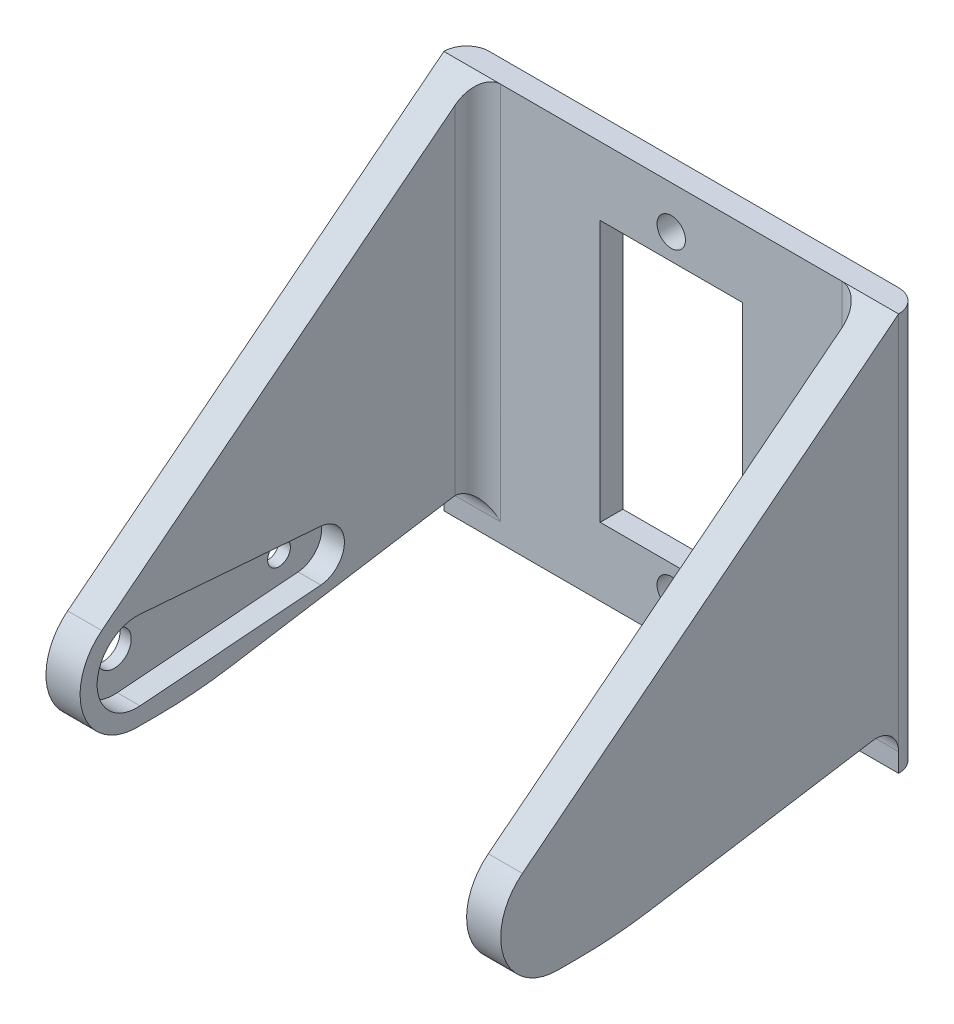
ISO-10303-21;
HEADER;
FILE_DESCRIPTION(('STEP AP214'),'2;1');
FILE_NAME('part.step','',(''),(''),'','','');
FILE_SCHEMA(('AUTOMOTIVE_DESIGN { 1 0 10303 214 1 1 1 1 }'));
ENDSEC;
DATA;
#1=APPLICATION_CONTEXT('core data for automotive mechanical design processes');
#2=APPLICATION_PROTOCOL_DEFINITION('international standard','automotive_design',2000,#1);
#3=PRODUCT_CONTEXT('',#1,'mechanical');
#4=PRODUCT('Part','Part','',(#3));
#5=PRODUCT_RELATED_PRODUCT_CATEGORY('part','',(#4));
#6=PRODUCT_DEFINITION_FORMATION('','',#4);
#7=PRODUCT_DEFINITION_CONTEXT('part definition',#1,'design');
#8=PRODUCT_DEFINITION('design','',#6,#7);
#9=PRODUCT_DEFINITION_SHAPE('','',#8);
#10=(LENGTH_UNIT() NAMED_UNIT(*) SI_UNIT(.MILLI.,.METRE.));
#11=(NAMED_UNIT(*) PLANE_ANGLE_UNIT() SI_UNIT($,.RADIAN.));
#12=(NAMED_UNIT(*) SI_UNIT($,.STERADIAN.) SOLID_ANGLE_UNIT());
#13=UNCERTAINTY_MEASURE_WITH_UNIT(LENGTH_MEASURE(1.E-05),#10,'distance_accuracy_value','');
#14=(GEOMETRIC_REPRESENTATION_CONTEXT(3) GLOBAL_UNCERTAINTY_ASSIGNED_CONTEXT((#13)) GLOBAL_UNIT_ASSIGNED_CONTEXT((#10,
#11,#12)) REPRESENTATION_CONTEXT('',''));
#15=CARTESIAN_POINT('',(0.,0.,0.));
#16=DIRECTION('',(0.,0.,1.));
#17=DIRECTION('',(1.,0.,0.));
#18=AXIS2_PLACEMENT_3D('',#15,#16,#17);
#19=CARTESIAN_POINT('',(20.,-17.5,2.));
#20=DIRECTION('',(0.,1.,0.));
#21=DIRECTION('',(-1.,0.,0.));
#22=AXIS2_PLACEMENT_3D('',#19,#20,#21);
#23=PLANE('',#22);
#24=DIRECTION('',(0.,0.,1.));
#25=VECTOR('',#24,1.);
#26=CARTESIAN_POINT('',(17.,-17.5,2.));
#27=LINE('',#26,#25);
#28=CARTESIAN_POINT('',(17.,-17.5,30.1797780234432));
#29=VERTEX_POINT('',#28);
#30=CARTESIAN_POINT('',(17.,-17.5,32.));
#31=VERTEX_POINT('',#30);
#32=EDGE_CURVE('E247',#29,#31,#27,.T.);
#33=ORIENTED_EDGE('',*,*,#32,.F.);
#34=DIRECTION('',(1.,0.,0.));
#35=VECTOR('',#34,1.);
#36=CARTESIAN_POINT('',(20.,-17.5,30.1797780234432));
#37=LINE('',#36,#35);
#38=CARTESIAN_POINT('',(20.,-17.5,30.1797780234432));
#39=VERTEX_POINT('',#38);
#40=EDGE_CURVE('E384',#29,#39,#37,.T.);
#41=ORIENTED_EDGE('',*,*,#40,.T.);
#42=DIRECTION('',(0.,0.,-1.));
#43=VECTOR('',#42,1.);
#44=CARTESIAN_POINT('',(20.,-17.5,2.));
#45=LINE('',#44,#43);
#46=CARTESIAN_POINT('',(20.,-17.5,32.));
#47=VERTEX_POINT('',#46);
#48=EDGE_CURVE('E363',#47,#39,#45,.T.);
#49=ORIENTED_EDGE('',*,*,#48,.F.);
#50=DIRECTION('',(1.,0.,0.));
#51=VECTOR('',#50,1.);
#52=CARTESIAN_POINT('',(17.,-17.5,32.));
#53=LINE('',#52,#51);
#54=EDGE_CURVE('E254',#31,#47,#53,.T.);
#55=ORIENTED_EDGE('',*,*,#54,.F.);
#56=EDGE_LOOP('',(#33,#41,#49,#55));
#57=FACE_BOUND('',#56,.T.);
#58=ADVANCED_FACE('F35',(#57),#23,.F.);
#59=DIRECTION('',(0.,0.,-1.));
#60=VECTOR('',#59,1.);
#61=CARTESIAN_POINT('',(-20.,-17.5,2.));
#62=LINE('',#61,#60);
#63=CARTESIAN_POINT('',(-20.,-17.5,32.));
#64=VERTEX_POINT('',#63);
#65=CARTESIAN_POINT('',(-20.,-17.5,30.1797780234432));
#66=VERTEX_POINT('',#65);
#67=EDGE_CURVE('E370',#64,#66,#62,.T.);
#68=ORIENTED_EDGE('',*,*,#67,.T.);
#69=DIRECTION('',(1.,0.,0.));
#70=VECTOR('',#69,1.);
#71=CARTESIAN_POINT('',(20.,-17.5,30.1797780234432));
#72=LINE('',#71,#70);
#73=CARTESIAN_POINT('',(-17.,-17.5,30.1797780234432));
#74=VERTEX_POINT('',#73);
#75=EDGE_CURVE('E375',#66,#74,#72,.T.);
#76=ORIENTED_EDGE('',*,*,#75,.T.);
#77=DIRECTION('',(0.,0.,1.));
#78=VECTOR('',#77,1.);
#79=CARTESIAN_POINT('',(-17.,-17.5,2.));
#80=LINE('',#79,#78);
#81=CARTESIAN_POINT('',(-17.,-17.5,32.));
#82=VERTEX_POINT('',#81);
#83=EDGE_CURVE('E296',#74,#82,#80,.T.);
#84=ORIENTED_EDGE('',*,*,#83,.T.);
#85=DIRECTION('',(-1.,0.,0.));
#86=VECTOR('',#85,1.);
#87=CARTESIAN_POINT('',(-17.,-17.5,32.));
#88=LINE('',#87,#86);
#89=EDGE_CURVE('E144',#82,#64,#88,.T.);
#90=ORIENTED_EDGE('',*,*,#89,.T.);
#91=EDGE_LOOP('',(#68,#76,#84,#90));
#92=FACE_BOUND('',#91,.T.);
#93=ADVANCED_FACE('F502',(#92),#23,.F.);
#94=CARTESIAN_POINT('',(0.,0.,2.));
#95=DIRECTION('',(0.,0.,1.));
#96=DIRECTION('',(1.,0.,0.));
#97=AXIS2_PLACEMENT_3D('',#94,#95,#96);
#98=PLANE('',#97);
#99=CARTESIAN_POINT('',(0.,-13.75,2.));
#100=DIRECTION('',(0.,0.,1.));
#101=DIRECTION('',(1.,0.,0.));
#102=AXIS2_PLACEMENT_3D('',#99,#100,#101);
#103=CIRCLE('',#102,1.25);
#104=CARTESIAN_POINT('',(1.25,-13.75,2.));
#105=VERTEX_POINT('',#104);
#106=EDGE_CURVE('E309',#105,#105,#103,.T.);
#107=ORIENTED_EDGE('',*,*,#106,.F.);
#108=EDGE_LOOP('',(#107));
#109=FACE_BOUND('',#108,.T.);
#110=DIRECTION('',(0.,1.,0.));
#111=VECTOR('',#110,1.);
#112=CARTESIAN_POINT('',(20.,-17.5,2.));
#113=LINE('',#112,#111);
#114=CARTESIAN_POINT('',(20.,-17.5,2.));
#115=VERTEX_POINT('',#114);
#116=CARTESIAN_POINT('',(20.,-15.8454382241875,2.));
#117=VERTEX_POINT('',#116);
#118=EDGE_CURVE('E228',#115,#117,#113,.T.);
#119=ORIENTED_EDGE('',*,*,#118,.T.);
#120=DIRECTION('',(1.,0.,0.));
#121=VECTOR('',#120,1.);
#122=CARTESIAN_POINT('',(0.,-15.8454382241875,2.));
#123=LINE('',#122,#121);
#124=CARTESIAN_POINT('',(15.,-15.8454382241875,2.));
#125=VERTEX_POINT('',#124);
#126=EDGE_CURVE('E177',#117,#125,#123,.F.);
#127=ORIENTED_EDGE('',*,*,#126,.T.);
#128=DIRECTION('',(0.,-1.,0.));
#129=VECTOR('',#128,1.);
#130=CARTESIAN_POINT('',(15.,17.5,2.));
#131=LINE('',#130,#129);
#132=CARTESIAN_POINT('',(15.,17.5,2.));
#133=VERTEX_POINT('',#132);
#134=EDGE_CURVE('E175',#125,#133,#131,.F.);
#135=ORIENTED_EDGE('',*,*,#134,.T.);
#136=DIRECTION('',(-1.,0.,0.));
#137=VECTOR('',#136,1.);
#138=CARTESIAN_POINT('',(20.,17.5,2.));
#139=LINE('',#138,#137);
#140=CARTESIAN_POINT('',(-15.,17.5,2.));
#141=VERTEX_POINT('',#140);
#142=EDGE_CURVE('E360',#133,#141,#139,.T.);
#143=ORIENTED_EDGE('',*,*,#142,.T.);
#144=DIRECTION('',(0.,-1.,0.));
#145=VECTOR('',#144,1.);
#146=CARTESIAN_POINT('',(-15.,-13.5,2.));
#147=LINE('',#146,#145);
#148=CARTESIAN_POINT('',(-15.,-15.8454382241875,2.));
#149=VERTEX_POINT('',#148);
#150=EDGE_CURVE('E148',#141,#149,#147,.T.);
#151=ORIENTED_EDGE('',*,*,#150,.T.);
#152=DIRECTION('',(1.,0.,0.));
#153=VECTOR('',#152,1.);
#154=CARTESIAN_POINT('',(0.,-15.8454382241875,2.));
#155=LINE('',#154,#153);
#156=CARTESIAN_POINT('',(-20.,-15.8454382241875,2.));
#157=VERTEX_POINT('',#156);
#158=EDGE_CURVE('E172',#149,#157,#155,.F.);
#159=ORIENTED_EDGE('',*,*,#158,.T.);
#160=DIRECTION('',(0.,1.,0.));
#161=VECTOR('',#160,1.);
#162=CARTESIAN_POINT('',(-20.,-17.5,2.));
#163=LINE('',#162,#161);
#164=CARTESIAN_POINT('',(-20.,-17.5,2.));
#165=VERTEX_POINT('',#164);
#166=EDGE_CURVE('E220',#165,#157,#163,.T.);
#167=ORIENTED_EDGE('',*,*,#166,.F.);
#168=DIRECTION('',(1.,0.,0.));
#169=VECTOR('',#168,1.);
#170=CARTESIAN_POINT('',(20.,-17.5,2.));
#171=LINE('',#170,#169);
#172=EDGE_CURVE('E357',#165,#115,#171,.T.);
#173=ORIENTED_EDGE('',*,*,#172,.T.);
#174=EDGE_LOOP('',(#119,#127,#135,#143,#151,#159,#167,#173));
#175=FACE_BOUND('',#174,.T.);
#176=CARTESIAN_POINT('',(0.,13.75,2.));
#177=DIRECTION('',(0.,0.,1.));
#178=DIRECTION('',(1.,0.,0.));
#179=AXIS2_PLACEMENT_3D('',#176,#177,#178);
#180=CIRCLE('',#179,1.25);
#181=CARTESIAN_POINT('',(1.25,13.75,2.));
#182=VERTEX_POINT('',#181);
#183=EDGE_CURVE('E315',#182,#182,#180,.T.);
#184=ORIENTED_EDGE('',*,*,#183,.F.);
#185=EDGE_LOOP('',(#184));
#186=FACE_BOUND('',#185,.T.);
#187=DIRECTION('',(-1.,0.,0.));
#188=VECTOR('',#187,1.);
#189=CARTESIAN_POINT('',(-6.25,11.5,2.));
#190=LINE('',#189,#188);
#191=CARTESIAN_POINT('',(6.25,11.5,2.));
#192=VERTEX_POINT('',#191);
#193=CARTESIAN_POINT('',(-6.25,11.5,2.));
#194=VERTEX_POINT('',#193);
#195=EDGE_CURVE('E324',#192,#194,#190,.T.);
#196=ORIENTED_EDGE('',*,*,#195,.F.);
#197=DIRECTION('',(0.,1.,0.));
#198=VECTOR('',#197,1.);
#199=CARTESIAN_POINT('',(6.25,11.5,2.));
#200=LINE('',#199,#198);
#201=CARTESIAN_POINT('',(6.25,-11.5,2.));
#202=VERTEX_POINT('',#201);
#203=EDGE_CURVE('E321',#202,#192,#200,.T.);
#204=ORIENTED_EDGE('',*,*,#203,.F.);
#205=DIRECTION('',(1.,0.,0.));
#206=VECTOR('',#205,1.);
#207=CARTESIAN_POINT('',(-6.25,-11.5,2.));
#208=LINE('',#207,#206);
#209=CARTESIAN_POINT('',(-6.25,-11.5,2.));
#210=VERTEX_POINT('',#209);
#211=EDGE_CURVE('E331',#210,#202,#208,.T.);
#212=ORIENTED_EDGE('',*,*,#211,.F.);
#213=DIRECTION('',(0.,-1.,0.));
#214=VECTOR('',#213,1.);
#215=CARTESIAN_POINT('',(-6.25,11.5,2.));
#216=LINE('',#215,#214);
#217=EDGE_CURVE('E328',#194,#210,#216,.T.);
#218=ORIENTED_EDGE('',*,*,#217,.F.);
#219=EDGE_LOOP('',(#196,#204,#212,#218));
#220=FACE_BOUND('',#219,.T.);
#221=ADVANCED_FACE('F511',(#109,#175,#186,#220),#98,.T.);
#222=CARTESIAN_POINT('',(0.,0.,0.));
#223=DIRECTION('',(0.,0.,1.));
#224=DIRECTION('',(1.,0.,0.));
#225=AXIS2_PLACEMENT_3D('',#222,#223,#224);
#226=PLANE('',#225);
#227=DIRECTION('',(-1.,0.,0.));
#228=VECTOR('',#227,1.);
#229=CARTESIAN_POINT('',(20.,17.5,0.));
#230=LINE('',#229,#228);
#231=CARTESIAN_POINT('',(18.,17.5,0.));
#232=VERTEX_POINT('',#231);
#233=CARTESIAN_POINT('',(-18.,17.5,0.));
#234=VERTEX_POINT('',#233);
#235=EDGE_CURVE('E361',#232,#234,#230,.T.);
#236=ORIENTED_EDGE('',*,*,#235,.F.);
#237=DIRECTION('',(0.,1.,0.));
#238=VECTOR('',#237,1.);
#239=CARTESIAN_POINT('',(18.,0.,0.));
#240=LINE('',#239,#238);
#241=CARTESIAN_POINT('',(18.,-17.5,0.));
#242=VERTEX_POINT('',#241);
#243=EDGE_CURVE('E192',#232,#242,#240,.F.);
#244=ORIENTED_EDGE('',*,*,#243,.T.);
#245=DIRECTION('',(1.,0.,0.));
#246=VECTOR('',#245,1.);
#247=CARTESIAN_POINT('',(20.,-17.5,0.));
#248=LINE('',#247,#246);
#249=CARTESIAN_POINT('',(-18.,-17.5,0.));
#250=VERTEX_POINT('',#249);
#251=EDGE_CURVE('E356',#250,#242,#248,.T.);
#252=ORIENTED_EDGE('',*,*,#251,.F.);
#253=DIRECTION('',(0.,-1.,0.));
#254=VECTOR('',#253,1.);
#255=CARTESIAN_POINT('',(-18.,0.,0.));
#256=LINE('',#255,#254);
#257=EDGE_CURVE('E190',#250,#234,#256,.F.);
#258=ORIENTED_EDGE('',*,*,#257,.T.);
#259=EDGE_LOOP('',(#236,#244,#252,#258));
#260=FACE_BOUND('',#259,.T.);
#261=DIRECTION('',(0.,1.,0.));
#262=VECTOR('',#261,1.);
#263=CARTESIAN_POINT('',(6.25,11.5,0.));
#264=LINE('',#263,#262);
#265=CARTESIAN_POINT('',(6.25,-11.5,0.));
#266=VERTEX_POINT('',#265);
#267=CARTESIAN_POINT('',(6.25,11.5,0.));
#268=VERTEX_POINT('',#267);
#269=EDGE_CURVE('E318',#266,#268,#264,.T.);
#270=ORIENTED_EDGE('',*,*,#269,.T.);
#271=DIRECTION('',(-1.,0.,0.));
#272=VECTOR('',#271,1.);
#273=CARTESIAN_POINT('',(-6.25,11.5,0.));
#274=LINE('',#273,#272);
#275=CARTESIAN_POINT('',(-6.25,11.5,0.));
#276=VERTEX_POINT('',#275);
#277=EDGE_CURVE('E337',#268,#276,#274,.T.);
#278=ORIENTED_EDGE('',*,*,#277,.T.);
#279=DIRECTION('',(0.,-1.,0.));
#280=VECTOR('',#279,1.);
#281=CARTESIAN_POINT('',(-6.25,11.5,0.));
#282=LINE('',#281,#280);
#283=CARTESIAN_POINT('',(-6.25,-11.5,0.));
#284=VERTEX_POINT('',#283);
#285=EDGE_CURVE('E340',#276,#284,#282,.T.);
#286=ORIENTED_EDGE('',*,*,#285,.T.);
#287=DIRECTION('',(1.,0.,0.));
#288=VECTOR('',#287,1.);
#289=CARTESIAN_POINT('',(-6.25,-11.5,0.));
#290=LINE('',#289,#288);
#291=EDGE_CURVE('E325',#284,#266,#290,.T.);
#292=ORIENTED_EDGE('',*,*,#291,.T.);
#293=EDGE_LOOP('',(#270,#278,#286,#292));
#294=FACE_BOUND('',#293,.T.);
#295=CARTESIAN_POINT('',(0.,13.75,0.));
#296=DIRECTION('',(0.,0.,1.));
#297=DIRECTION('',(1.,0.,0.));
#298=AXIS2_PLACEMENT_3D('',#295,#296,#297);
#299=CIRCLE('',#298,1.25);
#300=CARTESIAN_POINT('',(1.25,13.75,0.));
#301=VERTEX_POINT('',#300);
#302=EDGE_CURVE('E312',#301,#301,#299,.T.);
#303=ORIENTED_EDGE('',*,*,#302,.T.);
#304=EDGE_LOOP('',(#303));
#305=FACE_BOUND('',#304,.T.);
#306=CARTESIAN_POINT('',(0.,-13.75,0.));
#307=DIRECTION('',(0.,0.,1.));
#308=DIRECTION('',(1.,0.,0.));
#309=AXIS2_PLACEMENT_3D('',#306,#307,#308);
#310=CIRCLE('',#309,1.25);
#311=CARTESIAN_POINT('',(1.25,-13.75,0.));
#312=VERTEX_POINT('',#311);
#313=EDGE_CURVE('E305',#312,#312,#310,.T.);
#314=ORIENTED_EDGE('',*,*,#313,.T.);
#315=EDGE_LOOP('',(#314));
#316=FACE_BOUND('',#315,.T.);
#317=ADVANCED_FACE('F550',(#260,#294,#305,#316),#226,.F.);
#318=CARTESIAN_POINT('',(-20.,-17.5,2.));
#319=DIRECTION('',(1.,0.,0.));
#320=DIRECTION('',(0.,0.,-1.));
#321=AXIS2_PLACEMENT_3D('',#318,#319,#320);
#322=PLANE('',#321);
#323=CARTESIAN_POINT('',(-20.,-12.5,17.5));
#324=DIRECTION('',(1.,0.,0.));
#325=DIRECTION('',(0.,0.,-1.));
#326=AXIS2_PLACEMENT_3D('',#323,#324,#325);
#327=CIRCLE('',#326,1.);
#328=CARTESIAN_POINT('',(-20.,-12.5,16.5));
#329=VERTEX_POINT('',#328);
#330=EDGE_CURVE('E163',#329,#329,#327,.T.);
#331=ORIENTED_EDGE('',*,*,#330,.T.);
#332=EDGE_LOOP('',(#331));
#333=FACE_BOUND('',#332,.T.);
#334=CARTESIAN_POINT('',(-20.,-12.5,32.));
#335=DIRECTION('',(1.,0.,0.));
#336=DIRECTION('',(0.,0.,-1.));
#337=AXIS2_PLACEMENT_3D('',#334,#335,#336);
#338=CIRCLE('',#337,1.5);
#339=CARTESIAN_POINT('',(-20.,-12.5,30.5));
#340=VERTEX_POINT('',#339);
#341=EDGE_CURVE('E231',#340,#340,#338,.T.);
#342=ORIENTED_EDGE('',*,*,#341,.T.);
#343=EDGE_LOOP('',(#342));
#344=FACE_BOUND('',#343,.T.);
#345=DIRECTION('',(0.,0.618845814431364,-0.78551248109803));
#346=VECTOR('',#345,1.);
#347=CARTESIAN_POINT('',(-20.,-8.57243759450986,35.0942290721568));
#348=LINE('',#347,#346);
#349=CARTESIAN_POINT('',(-20.,-8.57243759450986,35.0942290721568));
#350=VERTEX_POINT('',#349);
#351=CARTESIAN_POINT('',(-20.,17.5,2.));
#352=VERTEX_POINT('',#351);
#353=EDGE_CURVE('E299',#350,#352,#348,.T.);
#354=ORIENTED_EDGE('',*,*,#353,.T.);
#355=DIRECTION('',(0.,-1.,0.));
#356=VECTOR('',#355,1.);
#357=CARTESIAN_POINT('',(-20.,-17.5,2.));
#358=LINE('',#357,#356);
#359=EDGE_CURVE('E11',#352,#157,#358,.T.);
#360=ORIENTED_EDGE('',*,*,#359,.T.);
#361=CARTESIAN_POINT('',(-20.,-15.8454382241875,4.));
#362=DIRECTION('',(1.,0.,0.));
#363=DIRECTION('',(0.,0.,-1.));
#364=AXIS2_PLACEMENT_3D('',#361,#362,#363);
#365=CIRCLE('',#364,2.);
#366=CARTESIAN_POINT('',(-20.,-13.8705569603541,4.31598100221335));
#367=VERTEX_POINT('',#366);
#368=EDGE_CURVE('E153',#157,#367,#365,.T.);
#369=ORIENTED_EDGE('',*,*,#368,.T.);
#370=DIRECTION('',(0.,-0.157990501106673,0.987440631916705));
#371=VECTOR('',#370,1.);
#372=CARTESIAN_POINT('',(-20.,-13.5,2.));
#373=LINE('',#372,#371);
#374=CARTESIAN_POINT('',(-20.,-16.9976252766682,23.8601579791763));
#375=VERTEX_POINT('',#374);
#376=EDGE_CURVE('E210',#367,#375,#373,.T.);
#377=ORIENTED_EDGE('',*,*,#376,.T.);
#378=CARTESIAN_POINT('',(-20.,22.5,30.1797780234432));
#379=DIRECTION('',(1.,0.,0.));
#380=DIRECTION('',(0.,0.,-1.));
#381=AXIS2_PLACEMENT_3D('',#378,#379,#380);
#382=CIRCLE('',#381,40.);
#383=EDGE_CURVE('E382',#375,#66,#382,.F.);
#384=ORIENTED_EDGE('',*,*,#383,.T.);
#385=ORIENTED_EDGE('',*,*,#67,.F.);
#386=CARTESIAN_POINT('',(-20.,-12.5,32.));
#387=DIRECTION('',(-1.,0.,0.));
#388=DIRECTION('',(0.,0.,-1.));
#389=AXIS2_PLACEMENT_3D('',#386,#387,#388);
#390=CIRCLE('',#389,5.);
#391=EDGE_CURVE('E287',#64,#350,#390,.T.);
#392=ORIENTED_EDGE('',*,*,#391,.T.);
#393=EDGE_LOOP('',(#354,#360,#369,#377,#384,#385,#392));
#394=FACE_BOUND('',#393,.T.);
#395=ADVANCED_FACE('F207',(#333,#344,#394),#322,.F.);
#396=ORIENTED_EDGE('',*,*,#251,.T.);
#397=CARTESIAN_POINT('',(18.,-17.5,2.));
#398=DIRECTION('',(0.,1.,0.));
#399=DIRECTION('',(-1.,0.,0.));
#400=AXIS2_PLACEMENT_3D('',#397,#398,#399);
#401=CIRCLE('',#400,2.);
#402=EDGE_CURVE('E196',#242,#115,#401,.F.);
#403=ORIENTED_EDGE('',*,*,#402,.T.);
#404=ORIENTED_EDGE('',*,*,#172,.F.);
#405=CARTESIAN_POINT('',(-18.,-17.5,2.));
#406=DIRECTION('',(0.,1.,0.));
#407=DIRECTION('',(-1.,0.,0.));
#408=AXIS2_PLACEMENT_3D('',#405,#406,#407);
#409=CIRCLE('',#408,2.);
#410=EDGE_CURVE('E194',#165,#250,#409,.F.);
#411=ORIENTED_EDGE('',*,*,#410,.T.);
#412=EDGE_LOOP('',(#396,#403,#404,#411));
#413=FACE_BOUND('',#412,.T.);
#414=ADVANCED_FACE('F517',(#413),#23,.F.);
#415=CARTESIAN_POINT('',(20.,-17.5,2.));
#416=DIRECTION('',(-1.,0.,0.));
#417=DIRECTION('',(0.,0.,1.));
#418=AXIS2_PLACEMENT_3D('',#415,#416,#417);
#419=PLANE('',#418);
#420=CARTESIAN_POINT('',(20.,-15.8454382241875,4.));
#421=DIRECTION('',(-1.,0.,0.));
#422=DIRECTION('',(0.,0.,1.));
#423=AXIS2_PLACEMENT_3D('',#420,#421,#422);
#424=CIRCLE('',#423,2.);
#425=CARTESIAN_POINT('',(20.,-13.8705569603541,4.31598100221335));
#426=VERTEX_POINT('',#425);
#427=EDGE_CURVE('E131',#426,#117,#424,.T.);
#428=ORIENTED_EDGE('',*,*,#427,.T.);
#429=DIRECTION('',(0.,1.,0.));
#430=VECTOR('',#429,1.);
#431=CARTESIAN_POINT('',(20.,-17.5,2.));
#432=LINE('',#431,#430);
#433=CARTESIAN_POINT('',(20.,17.5,2.));
#434=VERTEX_POINT('',#433);
#435=EDGE_CURVE('E44',#117,#434,#432,.T.);
#436=ORIENTED_EDGE('',*,*,#435,.T.);
#437=DIRECTION('',(0.,0.618845814431364,-0.78551248109803));
#438=VECTOR('',#437,1.);
#439=CARTESIAN_POINT('',(20.,-8.57243759450986,35.0942290721568));
#440=LINE('',#439,#438);
#441=CARTESIAN_POINT('',(20.,-8.57243759450986,35.0942290721568));
#442=VERTEX_POINT('',#441);
#443=EDGE_CURVE('E237',#442,#434,#440,.T.);
#444=ORIENTED_EDGE('',*,*,#443,.F.);
#445=CARTESIAN_POINT('',(20.,-12.5,32.));
#446=DIRECTION('',(-1.,0.,0.));
#447=DIRECTION('',(0.,0.,-1.));
#448=AXIS2_PLACEMENT_3D('',#445,#446,#447);
#449=CIRCLE('',#448,5.);
#450=EDGE_CURVE('E244',#47,#442,#449,.T.);
#451=ORIENTED_EDGE('',*,*,#450,.F.);
#452=ORIENTED_EDGE('',*,*,#48,.T.);
#453=CARTESIAN_POINT('',(20.,22.5,30.1797780234432));
#454=DIRECTION('',(-1.,0.,0.));
#455=DIRECTION('',(0.,0.,1.));
#456=AXIS2_PLACEMENT_3D('',#453,#454,#455);
#457=CIRCLE('',#456,40.);
#458=CARTESIAN_POINT('',(20.,-16.9976252766682,23.8601579791763));
#459=VERTEX_POINT('',#458);
#460=EDGE_CURVE('E387',#39,#459,#457,.F.);
#461=ORIENTED_EDGE('',*,*,#460,.T.);
#462=DIRECTION('',(0.,-0.157990501106673,0.987440631916705));
#463=VECTOR('',#462,1.);
#464=CARTESIAN_POINT('',(20.,-13.5,2.));
#465=LINE('',#464,#463);
#466=EDGE_CURVE('E224',#426,#459,#465,.T.);
#467=ORIENTED_EDGE('',*,*,#466,.F.);
#468=EDGE_LOOP('',(#428,#436,#444,#451,#452,#461,#467));
#469=FACE_BOUND('',#468,.T.);
#470=ADVANCED_FACE('F402',(#469),#419,.F.);
#471=CARTESIAN_POINT('',(20.,17.5,2.));
#472=DIRECTION('',(0.,-1.,0.));
#473=DIRECTION('',(1.,0.,0.));
#474=AXIS2_PLACEMENT_3D('',#471,#472,#473);
#475=PLANE('',#474);
#476=EDGE_CURVE('E75',#434,#133,#139,.T.);
#477=ORIENTED_EDGE('',*,*,#476,.F.);
#478=CARTESIAN_POINT('',(18.,17.5,2.));
#479=DIRECTION('',(0.,-1.,0.));
#480=DIRECTION('',(1.,0.,0.));
#481=AXIS2_PLACEMENT_3D('',#478,#479,#480);
#482=CIRCLE('',#481,2.);
#483=EDGE_CURVE('E188',#434,#232,#482,.F.);
#484=ORIENTED_EDGE('',*,*,#483,.T.);
#485=ORIENTED_EDGE('',*,*,#235,.T.);
#486=CARTESIAN_POINT('',(-18.,17.5,2.));
#487=DIRECTION('',(0.,-1.,0.));
#488=DIRECTION('',(1.,0.,0.));
#489=AXIS2_PLACEMENT_3D('',#486,#487,#488);
#490=CIRCLE('',#489,2.);
#491=EDGE_CURVE('E186',#234,#352,#490,.F.);
#492=ORIENTED_EDGE('',*,*,#491,.T.);
#493=DIRECTION('',(-1.,0.,0.));
#494=VECTOR('',#493,1.);
#495=CARTESIAN_POINT('',(-17.,17.5,2.));
#496=LINE('',#495,#494);
#497=EDGE_CURVE('E52',#141,#352,#496,.T.);
#498=ORIENTED_EDGE('',*,*,#497,.F.);
#499=ORIENTED_EDGE('',*,*,#142,.F.);
#500=EDGE_LOOP('',(#477,#484,#485,#492,#498,#499));
#501=FACE_BOUND('',#500,.T.);
#502=ADVANCED_FACE('F549',(#501),#475,.F.);
#503=CARTESIAN_POINT('',(6.25,11.5,2.));
#504=DIRECTION('',(-1.,0.,0.));
#505=DIRECTION('',(0.,-1.,0.));
#506=AXIS2_PLACEMENT_3D('',#503,#504,#505);
#507=PLANE('',#506);
#508=ORIENTED_EDGE('',*,*,#269,.F.);
#509=DIRECTION('',(0.,0.,-1.));
#510=VECTOR('',#509,1.);
#511=CARTESIAN_POINT('',(6.25,-11.5,2.));
#512=LINE('',#511,#510);
#513=EDGE_CURVE('E334',#202,#266,#512,.T.);
#514=ORIENTED_EDGE('',*,*,#513,.F.);
#515=ORIENTED_EDGE('',*,*,#203,.T.);
#516=DIRECTION('',(0.,0.,-1.));
#517=VECTOR('',#516,1.);
#518=CARTESIAN_POINT('',(6.25,11.5,2.));
#519=LINE('',#518,#517);
#520=EDGE_CURVE('E353',#192,#268,#519,.T.);
#521=ORIENTED_EDGE('',*,*,#520,.T.);
#522=EDGE_LOOP('',(#508,#514,#515,#521));
#523=FACE_BOUND('',#522,.T.);
#524=ADVANCED_FACE('F638',(#523),#507,.T.);
#525=CARTESIAN_POINT('',(-6.25,11.5,2.));
#526=DIRECTION('',(0.,-1.,0.));
#527=DIRECTION('',(0.,0.,-1.));
#528=AXIS2_PLACEMENT_3D('',#525,#526,#527);
#529=PLANE('',#528);
#530=ORIENTED_EDGE('',*,*,#277,.F.);
#531=ORIENTED_EDGE('',*,*,#520,.F.);
#532=ORIENTED_EDGE('',*,*,#195,.T.);
#533=DIRECTION('',(0.,0.,-1.));
#534=VECTOR('',#533,1.);
#535=CARTESIAN_POINT('',(-6.25,11.5,2.));
#536=LINE('',#535,#534);
#537=EDGE_CURVE('E350',#194,#276,#536,.T.);
#538=ORIENTED_EDGE('',*,*,#537,.T.);
#539=EDGE_LOOP('',(#530,#531,#532,#538));
#540=FACE_BOUND('',#539,.T.);
#541=ADVANCED_FACE('F634',(#540),#529,.T.);
#542=CARTESIAN_POINT('',(-6.25,11.5,2.));
#543=DIRECTION('',(1.,0.,0.));
#544=DIRECTION('',(0.,1.,0.));
#545=AXIS2_PLACEMENT_3D('',#542,#543,#544);
#546=PLANE('',#545);
#547=ORIENTED_EDGE('',*,*,#285,.F.);
#548=ORIENTED_EDGE('',*,*,#537,.F.);
#549=ORIENTED_EDGE('',*,*,#217,.T.);
#550=DIRECTION('',(0.,0.,-1.));
#551=VECTOR('',#550,1.);
#552=CARTESIAN_POINT('',(-6.25,-11.5,2.));
#553=LINE('',#552,#551);
#554=EDGE_CURVE('E347',#210,#284,#553,.T.);
#555=ORIENTED_EDGE('',*,*,#554,.T.);
#556=EDGE_LOOP('',(#547,#548,#549,#555));
#557=FACE_BOUND('',#556,.T.);
#558=ADVANCED_FACE('F630',(#557),#546,.T.);
#559=CARTESIAN_POINT('',(-6.25,-11.5,2.));
#560=DIRECTION('',(0.,1.,0.));
#561=DIRECTION('',(0.,0.,1.));
#562=AXIS2_PLACEMENT_3D('',#559,#560,#561);
#563=PLANE('',#562);
#564=ORIENTED_EDGE('',*,*,#291,.F.);
#565=ORIENTED_EDGE('',*,*,#554,.F.);
#566=ORIENTED_EDGE('',*,*,#211,.T.);
#567=ORIENTED_EDGE('',*,*,#513,.T.);
#568=EDGE_LOOP('',(#564,#565,#566,#567));
#569=FACE_BOUND('',#568,.T.);
#570=ADVANCED_FACE('F626',(#569),#563,.T.);
#571=CARTESIAN_POINT('',(0.,13.75,2.));
#572=DIRECTION('',(0.,0.,-1.));
#573=DIRECTION('',(-1.,0.,0.));
#574=AXIS2_PLACEMENT_3D('',#571,#572,#573);
#575=CYLINDRICAL_SURFACE('',#574,1.25);
#576=ORIENTED_EDGE('',*,*,#183,.T.);
#577=EDGE_LOOP('',(#576));
#578=FACE_BOUND('',#577,.T.);
#579=ORIENTED_EDGE('',*,*,#302,.F.);
#580=EDGE_LOOP('',(#579));
#581=FACE_BOUND('',#580,.T.);
#582=ADVANCED_FACE('F622',(#578,#581),#575,.F.);
#583=CARTESIAN_POINT('',(0.,-13.75,2.));
#584=DIRECTION('',(0.,0.,-1.));
#585=DIRECTION('',(-1.,0.,0.));
#586=AXIS2_PLACEMENT_3D('',#583,#584,#585);
#587=CYLINDRICAL_SURFACE('',#586,1.25);
#588=ORIENTED_EDGE('',*,*,#106,.T.);
#589=EDGE_LOOP('',(#588));
#590=FACE_BOUND('',#589,.T.);
#591=ORIENTED_EDGE('',*,*,#313,.F.);
#592=EDGE_LOOP('',(#591));
#593=FACE_BOUND('',#592,.T.);
#594=ADVANCED_FACE('F617',(#590,#593),#587,.F.);
#595=CARTESIAN_POINT('',(-17.,-8.57243759450986,35.0942290721568));
#596=DIRECTION('',(0.,0.78551248109803,0.618845814431363));
#597=DIRECTION('',(0.,-0.618845814431364,0.78551248109803));
#598=AXIS2_PLACEMENT_3D('',#595,#596,#597);
#599=PLANE('',#598);
#600=ORIENTED_EDGE('',*,*,#353,.F.);
#601=DIRECTION('',(-1.,0.,0.));
#602=VECTOR('',#601,1.);
#603=CARTESIAN_POINT('',(-17.,-8.57243759450986,35.0942290721568));
#604=LINE('',#603,#602);
#605=CARTESIAN_POINT('',(-17.,-8.57243759450986,35.0942290721568));
#606=VERTEX_POINT('',#605);
#607=EDGE_CURVE('E142',#606,#350,#604,.T.);
#608=ORIENTED_EDGE('',*,*,#607,.F.);
#609=DIRECTION('',(0.,0.618845814431364,-0.78551248109803));
#610=VECTOR('',#609,1.);
#611=CARTESIAN_POINT('',(-17.,-8.57243759450986,35.0942290721568));
#612=LINE('',#611,#610);
#613=CARTESIAN_POINT('',(-17.,15.9243514156101,3.99999999999999));
#614=VERTEX_POINT('',#613);
#615=EDGE_CURVE('E127',#606,#614,#612,.T.);
#616=ORIENTED_EDGE('',*,*,#615,.T.);
#617=CARTESIAN_POINT('',(-15.,15.9243514156101,4.));
#618=DIRECTION('',(0.,0.78551248109803,0.618845814431363));
#619=DIRECTION('',(0.,0.618845814431364,-0.78551248109803));
#620=AXIS2_PLACEMENT_3D('',#617,#618,#619);
#621=ELLIPSE('',#620,2.54610849366047,2.);
#622=EDGE_CURVE('E139',#614,#141,#621,.F.);
#623=ORIENTED_EDGE('',*,*,#622,.T.);
#624=ORIENTED_EDGE('',*,*,#497,.T.);
#625=EDGE_LOOP('',(#600,#608,#616,#623,#624));
#626=FACE_BOUND('',#625,.T.);
#627=ADVANCED_FACE('F138',(#626),#599,.T.);
#628=CARTESIAN_POINT('',(-17.,-12.5,32.));
#629=DIRECTION('',(-1.,0.,0.));
#630=DIRECTION('',(0.,0.,1.));
#631=AXIS2_PLACEMENT_3D('',#628,#629,#630);
#632=CYLINDRICAL_SURFACE('',#631,5.);
#633=ORIENTED_EDGE('',*,*,#391,.F.);
#634=ORIENTED_EDGE('',*,*,#89,.F.);
#635=CARTESIAN_POINT('',(-17.,-12.5,32.));
#636=DIRECTION('',(-1.,0.,0.));
#637=DIRECTION('',(0.,0.,-1.));
#638=AXIS2_PLACEMENT_3D('',#635,#636,#637);
#639=CIRCLE('',#638,5.);
#640=EDGE_CURVE('E145',#82,#606,#639,.T.);
#641=ORIENTED_EDGE('',*,*,#640,.T.);
#642=ORIENTED_EDGE('',*,*,#607,.T.);
#643=EDGE_LOOP('',(#633,#634,#641,#642));
#644=FACE_BOUND('',#643,.T.);
#645=ADVANCED_FACE('F506',(#644),#632,.T.);
#646=CARTESIAN_POINT('',(-17.,-12.5,32.));
#647=DIRECTION('',(1.,0.,0.));
#648=DIRECTION('',(0.,0.,-1.));
#649=AXIS2_PLACEMENT_3D('',#646,#647,#648);
#650=PLANE('',#649);
#651=CARTESIAN_POINT('',(-17.,-15.8454382241875,4.));
#652=DIRECTION('',(1.,0.,0.));
#653=DIRECTION('',(0.,0.,-1.));
#654=AXIS2_PLACEMENT_3D('',#651,#652,#653);
#655=CIRCLE('',#654,2.);
#656=CARTESIAN_POINT('',(-17.,-13.8705569603541,4.31598100221334));
#657=VERTEX_POINT('',#656);
#658=CARTESIAN_POINT('',(-17.,-13.8454382241875,4.));
#659=VERTEX_POINT('',#658);
#660=EDGE_CURVE('E129',#657,#659,#655,.F.);
#661=ORIENTED_EDGE('',*,*,#660,.T.);
#662=DIRECTION('',(0.,-1.,0.));
#663=VECTOR('',#662,1.);
#664=CARTESIAN_POINT('',(-17.,17.5,4.));
#665=LINE('',#664,#663);
#666=EDGE_CURVE('E61',#659,#614,#665,.F.);
#667=ORIENTED_EDGE('',*,*,#666,.T.);
#668=ORIENTED_EDGE('',*,*,#615,.F.);
#669=ORIENTED_EDGE('',*,*,#640,.F.);
#670=ORIENTED_EDGE('',*,*,#83,.F.);
#671=CARTESIAN_POINT('',(-17.,22.5,30.1797780234432));
#672=DIRECTION('',(1.,0.,0.));
#673=DIRECTION('',(0.,0.,-1.));
#674=AXIS2_PLACEMENT_3D('',#671,#672,#673);
#675=CIRCLE('',#674,40.);
#676=CARTESIAN_POINT('',(-17.,-16.9976252766682,23.8601579791763));
#677=VERTEX_POINT('',#676);
#678=EDGE_CURVE('E378',#74,#677,#675,.T.);
#679=ORIENTED_EDGE('',*,*,#678,.T.);
#680=DIRECTION('',(0.,-0.157990501106673,0.987440631916705));
#681=VECTOR('',#680,1.);
#682=CARTESIAN_POINT('',(-17.,-18.1552262090484,31.0951638065523));
#683=LINE('',#682,#681);
#684=EDGE_CURVE('E219',#657,#677,#683,.T.);
#685=ORIENTED_EDGE('',*,*,#684,.F.);
#686=EDGE_LOOP('',(#661,#667,#668,#669,#670,#679,#685));
#687=FACE_BOUND('',#686,.T.);
#688=DIRECTION('',(0.,0.0781249999999998,-0.996943571309329));
#689=VECTOR('',#688,1.);
#690=CARTESIAN_POINT('',(-17.,-13.4206496259968,-1.05170270635677));
#691=LINE('',#690,#689);
#692=CARTESIAN_POINT('',(-17.,-15.9893024995827,31.7265625));
#693=VERTEX_POINT('',#692);
#694=CARTESIAN_POINT('',(-17.,-14.743123035446,15.82421875));
#695=VERTEX_POINT('',#694);
#696=EDGE_CURVE('E257',#693,#695,#691,.T.);
#697=ORIENTED_EDGE('',*,*,#696,.F.);
#698=CARTESIAN_POINT('',(-17.,-12.5,32.));
#699=DIRECTION('',(1.,0.,0.));
#700=DIRECTION('',(0.,0.,-1.));
#701=AXIS2_PLACEMENT_3D('',#698,#699,#700);
#702=CIRCLE('',#701,3.5);
#703=CARTESIAN_POINT('',(-17.,-9.01069750041735,31.7265625));
#704=VERTEX_POINT('',#703);
#705=EDGE_CURVE('E264',#704,#693,#702,.T.);
#706=ORIENTED_EDGE('',*,*,#705,.F.);
#707=DIRECTION('',(0.,-0.0781250000000002,-0.996943571309329));
#708=VECTOR('',#707,1.);
#709=CARTESIAN_POINT('',(-17.,-11.4267624833782,0.89545270635677));
#710=LINE('',#709,#708);
#711=CARTESIAN_POINT('',(-17.,-10.256876964554,15.82421875));
#712=VERTEX_POINT('',#711);
#713=EDGE_CURVE('E279',#704,#712,#710,.T.);
#714=ORIENTED_EDGE('',*,*,#713,.T.);
#715=CARTESIAN_POINT('',(-17.,-12.5,16.));
#716=DIRECTION('',(1.,0.,0.));
#717=DIRECTION('',(0.,0.,-1.));
#718=AXIS2_PLACEMENT_3D('',#715,#716,#717);
#719=CIRCLE('',#718,2.25);
#720=EDGE_CURVE('E276',#695,#712,#719,.T.);
#721=ORIENTED_EDGE('',*,*,#720,.F.);
#722=EDGE_LOOP('',(#697,#706,#714,#721));
#723=FACE_BOUND('',#722,.T.);
#724=ADVANCED_FACE('F123',(#687,#723),#650,.T.);
#725=CARTESIAN_POINT('',(-19.,-13.4206496259968,-1.05170270635677));
#726=DIRECTION('',(0.,-0.996943571309329,-0.0781249999999998));
#727=DIRECTION('',(0.,0.0781249999999998,-0.996943571309329));
#728=AXIS2_PLACEMENT_3D('',#725,#726,#727);
#729=PLANE('',#728);
#730=ORIENTED_EDGE('',*,*,#696,.T.);
#731=DIRECTION('',(1.,0.,0.));
#732=VECTOR('',#731,1.);
#733=CARTESIAN_POINT('',(-19.,-14.743123035446,15.82421875));
#734=LINE('',#733,#732);
#735=CARTESIAN_POINT('',(-19.,-14.743123035446,15.82421875));
#736=VERTEX_POINT('',#735);
#737=EDGE_CURVE('E273',#736,#695,#734,.T.);
#738=ORIENTED_EDGE('',*,*,#737,.F.);
#739=DIRECTION('',(0.,0.0781249999999998,-0.996943571309329));
#740=VECTOR('',#739,1.);
#741=CARTESIAN_POINT('',(-19.,-13.4206496259968,-1.05170270635677));
#742=LINE('',#741,#740);
#743=CARTESIAN_POINT('',(-19.,-15.9893024995827,31.7265625));
#744=VERTEX_POINT('',#743);
#745=EDGE_CURVE('E260',#744,#736,#742,.T.);
#746=ORIENTED_EDGE('',*,*,#745,.F.);
#747=DIRECTION('',(1.,0.,0.));
#748=VECTOR('',#747,1.);
#749=CARTESIAN_POINT('',(-19.,-15.9893024995827,31.7265625));
#750=LINE('',#749,#748);
#751=EDGE_CURVE('E284',#744,#693,#750,.T.);
#752=ORIENTED_EDGE('',*,*,#751,.T.);
#753=EDGE_LOOP('',(#730,#738,#746,#752));
#754=FACE_BOUND('',#753,.T.);
#755=ADVANCED_FACE('F602',(#754),#729,.F.);
#756=CARTESIAN_POINT('',(-19.,-12.5,32.));
#757=DIRECTION('',(1.,0.,0.));
#758=DIRECTION('',(0.,0.,-1.));
#759=AXIS2_PLACEMENT_3D('',#756,#757,#758);
#760=CYLINDRICAL_SURFACE('',#759,3.5);
#761=ORIENTED_EDGE('',*,*,#705,.T.);
#762=ORIENTED_EDGE('',*,*,#751,.F.);
#763=CARTESIAN_POINT('',(-19.,-12.5,32.));
#764=DIRECTION('',(1.,0.,0.));
#765=DIRECTION('',(0.,0.,-1.));
#766=AXIS2_PLACEMENT_3D('',#763,#764,#765);
#767=CIRCLE('',#766,3.5);
#768=CARTESIAN_POINT('',(-19.,-9.01069750041735,31.7265625));
#769=VERTEX_POINT('',#768);
#770=EDGE_CURVE('E270',#769,#744,#767,.T.);
#771=ORIENTED_EDGE('',*,*,#770,.F.);
#772=DIRECTION('',(1.,0.,0.));
#773=VECTOR('',#772,1.);
#774=CARTESIAN_POINT('',(-19.,-9.01069750041735,31.7265625));
#775=LINE('',#774,#773);
#776=EDGE_CURVE('E288',#769,#704,#775,.T.);
#777=ORIENTED_EDGE('',*,*,#776,.T.);
#778=EDGE_LOOP('',(#761,#762,#771,#777));
#779=FACE_BOUND('',#778,.T.);
#780=ADVANCED_FACE('F598',(#779),#760,.F.);
#781=CARTESIAN_POINT('',(-19.,-11.4267624833782,0.89545270635677));
#782=DIRECTION('',(0.,-0.996943571309329,0.0781250000000002));
#783=DIRECTION('',(0.,-0.0781250000000002,-0.996943571309329));
#784=AXIS2_PLACEMENT_3D('',#781,#782,#783);
#785=PLANE('',#784);
#786=ORIENTED_EDGE('',*,*,#713,.F.);
#787=ORIENTED_EDGE('',*,*,#776,.F.);
#788=DIRECTION('',(0.,-0.0781250000000002,-0.996943571309329));
#789=VECTOR('',#788,1.);
#790=CARTESIAN_POINT('',(-19.,-11.4267624833782,0.89545270635677));
#791=LINE('',#790,#789);
#792=CARTESIAN_POINT('',(-19.,-10.256876964554,15.82421875));
#793=VERTEX_POINT('',#792);
#794=EDGE_CURVE('E267',#769,#793,#791,.T.);
#795=ORIENTED_EDGE('',*,*,#794,.T.);
#796=DIRECTION('',(1.,0.,0.));
#797=VECTOR('',#796,1.);
#798=CARTESIAN_POINT('',(-19.,-10.256876964554,15.82421875));
#799=LINE('',#798,#797);
#800=EDGE_CURVE('E291',#793,#712,#799,.T.);
#801=ORIENTED_EDGE('',*,*,#800,.T.);
#802=EDGE_LOOP('',(#786,#787,#795,#801));
#803=FACE_BOUND('',#802,.T.);
#804=ADVANCED_FACE('F601',(#803),#785,.T.);
#805=CARTESIAN_POINT('',(-19.,-12.5,16.));
#806=DIRECTION('',(1.,0.,0.));
#807=DIRECTION('',(0.,0.,-1.));
#808=AXIS2_PLACEMENT_3D('',#805,#806,#807);
#809=CYLINDRICAL_SURFACE('',#808,2.25);
#810=ORIENTED_EDGE('',*,*,#720,.T.);
#811=ORIENTED_EDGE('',*,*,#800,.F.);
#812=CARTESIAN_POINT('',(-19.,-12.5,16.));
#813=DIRECTION('',(1.,0.,0.));
#814=DIRECTION('',(0.,0.,-1.));
#815=AXIS2_PLACEMENT_3D('',#812,#813,#814);
#816=CIRCLE('',#815,2.25);
#817=EDGE_CURVE('E263',#736,#793,#816,.T.);
#818=ORIENTED_EDGE('',*,*,#817,.F.);
#819=ORIENTED_EDGE('',*,*,#737,.T.);
#820=EDGE_LOOP('',(#810,#811,#818,#819));
#821=FACE_BOUND('',#820,.T.);
#822=ADVANCED_FACE('F596',(#821),#809,.F.);
#823=CARTESIAN_POINT('',(-19.,0.,0.));
#824=DIRECTION('',(1.,0.,0.));
#825=DIRECTION('',(0.,0.,-1.));
#826=AXIS2_PLACEMENT_3D('',#823,#824,#825);
#827=PLANE('',#826);
#828=CARTESIAN_POINT('',(-19.,-12.5,17.5));
#829=DIRECTION('',(1.,0.,0.));
#830=DIRECTION('',(0.,0.,-1.));
#831=AXIS2_PLACEMENT_3D('',#828,#829,#830);
#832=CIRCLE('',#831,1.);
#833=CARTESIAN_POINT('',(-19.,-12.5,16.5));
#834=VERTEX_POINT('',#833);
#835=EDGE_CURVE('E158',#834,#834,#832,.T.);
#836=ORIENTED_EDGE('',*,*,#835,.F.);
#837=EDGE_LOOP('',(#836));
#838=FACE_BOUND('',#837,.T.);
#839=CARTESIAN_POINT('',(-19.,-12.5,32.));
#840=DIRECTION('',(1.,0.,0.));
#841=DIRECTION('',(0.,0.,-1.));
#842=AXIS2_PLACEMENT_3D('',#839,#840,#841);
#843=CIRCLE('',#842,1.5);
#844=CARTESIAN_POINT('',(-19.,-12.5,30.5));
#845=VERTEX_POINT('',#844);
#846=EDGE_CURVE('E942',#845,#845,#843,.T.);
#847=ORIENTED_EDGE('',*,*,#846,.F.);
#848=EDGE_LOOP('',(#847));
#849=FACE_BOUND('',#848,.T.);
#850=ORIENTED_EDGE('',*,*,#745,.T.);
#851=ORIENTED_EDGE('',*,*,#817,.T.);
#852=ORIENTED_EDGE('',*,*,#794,.F.);
#853=ORIENTED_EDGE('',*,*,#770,.T.);
#854=EDGE_LOOP('',(#850,#851,#852,#853));
#855=FACE_BOUND('',#854,.T.);
#856=ADVANCED_FACE('F591',(#838,#849,#855),#827,.T.);
#857=CARTESIAN_POINT('',(17.,-12.5,32.));
#858=DIRECTION('',(1.,0.,0.));
#859=DIRECTION('',(0.,0.,-1.));
#860=AXIS2_PLACEMENT_3D('',#857,#858,#859);
#861=CYLINDRICAL_SURFACE('',#860,5.);
#862=ORIENTED_EDGE('',*,*,#450,.T.);
#863=DIRECTION('',(1.,0.,0.));
#864=VECTOR('',#863,1.);
#865=CARTESIAN_POINT('',(17.,-8.57243759450986,35.0942290721568));
#866=LINE('',#865,#864);
#867=CARTESIAN_POINT('',(17.,-8.57243759450986,35.0942290721568));
#868=VERTEX_POINT('',#867);
#869=EDGE_CURVE('E250',#868,#442,#866,.T.);
#870=ORIENTED_EDGE('',*,*,#869,.F.);
#871=CARTESIAN_POINT('',(17.,-12.5,32.));
#872=DIRECTION('',(-1.,0.,0.));
#873=DIRECTION('',(0.,0.,-1.));
#874=AXIS2_PLACEMENT_3D('',#871,#872,#873);
#875=CIRCLE('',#874,5.);
#876=EDGE_CURVE('E243',#31,#868,#875,.T.);
#877=ORIENTED_EDGE('',*,*,#876,.F.);
#878=ORIENTED_EDGE('',*,*,#54,.T.);
#879=EDGE_LOOP('',(#862,#870,#877,#878));
#880=FACE_BOUND('',#879,.T.);
#881=ADVANCED_FACE('F428',(#880),#861,.T.);
#882=CARTESIAN_POINT('',(17.,-8.57243759450986,35.0942290721568));
#883=DIRECTION('',(0.,-0.78551248109803,-0.618845814431363));
#884=DIRECTION('',(0.,0.618845814431364,-0.78551248109803));
#885=AXIS2_PLACEMENT_3D('',#882,#883,#884);
#886=PLANE('',#885);
#887=ORIENTED_EDGE('',*,*,#443,.T.);
#888=ORIENTED_EDGE('',*,*,#476,.T.);
#889=CARTESIAN_POINT('',(15.,15.9243514156101,4.));
#890=DIRECTION('',(0.,-0.78551248109803,-0.618845814431363));
#891=DIRECTION('',(0.,0.618845814431364,-0.78551248109803));
#892=AXIS2_PLACEMENT_3D('',#889,#890,#891);
#893=ELLIPSE('',#892,2.54610849366047,2.);
#894=CARTESIAN_POINT('',(17.,15.9243514156101,3.99999999999999));
#895=VERTEX_POINT('',#894);
#896=EDGE_CURVE('E149',#133,#895,#893,.T.);
#897=ORIENTED_EDGE('',*,*,#896,.T.);
#898=DIRECTION('',(0.,0.618845814431364,-0.78551248109803));
#899=VECTOR('',#898,1.);
#900=CARTESIAN_POINT('',(17.,-8.57243759450986,35.0942290721568));
#901=LINE('',#900,#899);
#902=EDGE_CURVE('E240',#868,#895,#901,.T.);
#903=ORIENTED_EDGE('',*,*,#902,.F.);
#904=ORIENTED_EDGE('',*,*,#869,.T.);
#905=EDGE_LOOP('',(#887,#888,#897,#903,#904));
#906=FACE_BOUND('',#905,.T.);
#907=ADVANCED_FACE('F588',(#906),#886,.F.);
#908=CARTESIAN_POINT('',(17.,-12.5,32.));
#909=DIRECTION('',(-1.,0.,0.));
#910=DIRECTION('',(0.,0.,-1.));
#911=AXIS2_PLACEMENT_3D('',#908,#909,#910);
#912=PLANE('',#911);
#913=ORIENTED_EDGE('',*,*,#902,.T.);
#914=DIRECTION('',(0.,-1.,0.));
#915=VECTOR('',#914,1.);
#916=CARTESIAN_POINT('',(17.,-13.5,4.));
#917=LINE('',#916,#915);
#918=CARTESIAN_POINT('',(17.,-13.8454382241875,4.));
#919=VERTEX_POINT('',#918);
#920=EDGE_CURVE('E132',#895,#919,#917,.T.);
#921=ORIENTED_EDGE('',*,*,#920,.T.);
#922=CARTESIAN_POINT('',(17.,-15.8454382241875,4.));
#923=DIRECTION('',(-1.,0.,0.));
#924=DIRECTION('',(0.,0.,1.));
#925=AXIS2_PLACEMENT_3D('',#922,#923,#924);
#926=CIRCLE('',#925,2.);
#927=CARTESIAN_POINT('',(17.,-13.8705569603541,4.31598100221334));
#928=VERTEX_POINT('',#927);
#929=EDGE_CURVE('E86',#919,#928,#926,.F.);
#930=ORIENTED_EDGE('',*,*,#929,.T.);
#931=DIRECTION('',(0.,0.157990501106673,-0.987440631916705));
#932=VECTOR('',#931,1.);
#933=CARTESIAN_POINT('',(17.,-18.1552262090484,31.0951638065523));
#934=LINE('',#933,#932);
#935=CARTESIAN_POINT('',(17.,-16.9976252766682,23.8601579791763));
#936=VERTEX_POINT('',#935);
#937=EDGE_CURVE('E373',#936,#928,#934,.T.);
#938=ORIENTED_EDGE('',*,*,#937,.F.);
#939=CARTESIAN_POINT('',(17.,22.5,30.1797780234432));
#940=DIRECTION('',(-1.,0.,0.));
#941=DIRECTION('',(0.,0.,1.));
#942=AXIS2_PLACEMENT_3D('',#939,#940,#941);
#943=CIRCLE('',#942,40.);
#944=EDGE_CURVE('E393',#936,#29,#943,.T.);
#945=ORIENTED_EDGE('',*,*,#944,.T.);
#946=ORIENTED_EDGE('',*,*,#32,.T.);
#947=ORIENTED_EDGE('',*,*,#876,.T.);
#948=EDGE_LOOP('',(#913,#921,#930,#938,#945,#946,#947));
#949=FACE_BOUND('',#948,.T.);
#950=CARTESIAN_POINT('',(17.,-12.5,32.));
#951=DIRECTION('',(-1.,0.,0.));
#952=DIRECTION('',(0.,0.,1.));
#953=AXIS2_PLACEMENT_3D('',#950,#951,#952);
#954=CIRCLE('',#953,2.5);
#955=CARTESIAN_POINT('',(17.,-12.5,34.5));
#956=VERTEX_POINT('',#955);
#957=EDGE_CURVE('E222',#956,#956,#954,.T.);
#958=ORIENTED_EDGE('',*,*,#957,.F.);
#959=EDGE_LOOP('',(#958));
#960=FACE_BOUND('',#959,.T.);
#961=ADVANCED_FACE('F413',(#949,#960),#912,.T.);
#962=CARTESIAN_POINT('',(15.5,-12.5,32.));
#963=DIRECTION('',(1.,0.,0.));
#964=DIRECTION('',(0.,0.,-1.));
#965=AXIS2_PLACEMENT_3D('',#962,#963,#964);
#966=CYLINDRICAL_SURFACE('',#965,2.5);
#967=CARTESIAN_POINT('',(15.5,-12.5,32.));
#968=DIRECTION('',(-1.,0.,0.));
#969=DIRECTION('',(0.,0.,1.));
#970=AXIS2_PLACEMENT_3D('',#967,#968,#969);
#971=CIRCLE('',#970,2.5);
#972=CARTESIAN_POINT('',(15.5,-12.5,34.5));
#973=VERTEX_POINT('',#972);
#974=EDGE_CURVE('E234',#973,#973,#971,.T.);
#975=ORIENTED_EDGE('',*,*,#974,.F.);
#976=EDGE_LOOP('',(#975));
#977=FACE_BOUND('',#976,.T.);
#978=ORIENTED_EDGE('',*,*,#957,.T.);
#979=EDGE_LOOP('',(#978));
#980=FACE_BOUND('',#979,.T.);
#981=ADVANCED_FACE('F581',(#977,#980),#966,.T.);
#982=CARTESIAN_POINT('',(15.5,-12.5,32.));
#983=DIRECTION('',(-1.,0.,0.));
#984=DIRECTION('',(0.,0.,1.));
#985=AXIS2_PLACEMENT_3D('',#982,#983,#984);
#986=PLANE('',#985);
#987=ORIENTED_EDGE('',*,*,#974,.T.);
#988=EDGE_LOOP('',(#987));
#989=FACE_BOUND('',#988,.T.);
#990=ADVANCED_FACE('F578',(#989),#986,.T.);
#991=CARTESIAN_POINT('',(-20.,-13.5,2.));
#992=DIRECTION('',(0.,0.987440631916705,0.157990501106673));
#993=DIRECTION('',(0.,-0.157990501106673,0.987440631916705));
#994=AXIS2_PLACEMENT_3D('',#991,#992,#993);
#995=PLANE('',#994);
#996=ORIENTED_EDGE('',*,*,#937,.T.);
#997=DIRECTION('',(1.,0.,0.));
#998=VECTOR('',#997,1.);
#999=CARTESIAN_POINT('',(-20.,-13.8705569603541,4.31598100221335));
#1000=LINE('',#999,#998);
#1001=EDGE_CURVE('E179',#928,#426,#1000,.T.);
#1002=ORIENTED_EDGE('',*,*,#1001,.T.);
#1003=ORIENTED_EDGE('',*,*,#466,.T.);
#1004=DIRECTION('',(1.,0.,0.));
#1005=VECTOR('',#1004,1.);
#1006=CARTESIAN_POINT('',(-20.,-16.9976252766682,23.8601579791763));
#1007=LINE('',#1006,#1005);
#1008=EDGE_CURVE('E390',#459,#936,#1007,.F.);
#1009=ORIENTED_EDGE('',*,*,#1008,.T.);
#1010=EDGE_LOOP('',(#996,#1002,#1003,#1009));
#1011=FACE_BOUND('',#1010,.T.);
#1012=ADVANCED_FACE('F399',(#1011),#995,.F.);
#1013=ORIENTED_EDGE('',*,*,#376,.F.);
#1014=DIRECTION('',(1.,0.,0.));
#1015=VECTOR('',#1014,1.);
#1016=CARTESIAN_POINT('',(-20.,-13.8705569603541,4.31598100221335));
#1017=LINE('',#1016,#1015);
#1018=EDGE_CURVE('E184',#367,#657,#1017,.T.);
#1019=ORIENTED_EDGE('',*,*,#1018,.T.);
#1020=ORIENTED_EDGE('',*,*,#684,.T.);
#1021=DIRECTION('',(1.,0.,0.));
#1022=VECTOR('',#1021,1.);
#1023=CARTESIAN_POINT('',(-20.,-16.9976252766682,23.8601579791763));
#1024=LINE('',#1023,#1022);
#1025=EDGE_CURVE('E217',#677,#375,#1024,.F.);
#1026=ORIENTED_EDGE('',*,*,#1025,.T.);
#1027=EDGE_LOOP('',(#1013,#1019,#1020,#1026));
#1028=FACE_BOUND('',#1027,.T.);
#1029=ADVANCED_FACE('F214',(#1028),#995,.F.);
#1030=CARTESIAN_POINT('',(20.,22.5,30.1797780234432));
#1031=DIRECTION('',(1.,0.,0.));
#1032=DIRECTION('',(0.,0.,-1.));
#1033=AXIS2_PLACEMENT_3D('',#1030,#1031,#1032);
#1034=CYLINDRICAL_SURFACE('',#1033,40.);
#1035=ORIENTED_EDGE('',*,*,#383,.F.);
#1036=ORIENTED_EDGE('',*,*,#1025,.F.);
#1037=ORIENTED_EDGE('',*,*,#678,.F.);
#1038=ORIENTED_EDGE('',*,*,#75,.F.);
#1039=EDGE_LOOP('',(#1035,#1036,#1037,#1038));
#1040=FACE_BOUND('',#1039,.T.);
#1041=ADVANCED_FACE('F500',(#1040),#1034,.T.);
#1042=CARTESIAN_POINT('',(20.,22.5,30.1797780234432));
#1043=DIRECTION('',(1.,0.,0.));
#1044=DIRECTION('',(0.,0.,-1.));
#1045=AXIS2_PLACEMENT_3D('',#1042,#1043,#1044);
#1046=CYLINDRICAL_SURFACE('',#1045,40.);
#1047=ORIENTED_EDGE('',*,*,#944,.F.);
#1048=ORIENTED_EDGE('',*,*,#1008,.F.);
#1049=ORIENTED_EDGE('',*,*,#460,.F.);
#1050=ORIENTED_EDGE('',*,*,#40,.F.);
#1051=EDGE_LOOP('',(#1047,#1048,#1049,#1050));
#1052=FACE_BOUND('',#1051,.T.);
#1053=ADVANCED_FACE('F412',(#1052),#1046,.T.);
#1054=CARTESIAN_POINT('',(-29.,-12.5,32.));
#1055=DIRECTION('',(1.,0.,0.));
#1056=DIRECTION('',(0.,0.,-1.));
#1057=AXIS2_PLACEMENT_3D('',#1054,#1055,#1056);
#1058=CYLINDRICAL_SURFACE('',#1057,1.5);
#1059=ORIENTED_EDGE('',*,*,#846,.T.);
#1060=EDGE_LOOP('',(#1059));
#1061=FACE_BOUND('',#1060,.T.);
#1062=ORIENTED_EDGE('',*,*,#341,.F.);
#1063=EDGE_LOOP('',(#1062));
#1064=FACE_BOUND('',#1063,.T.);
#1065=ADVANCED_FACE('F562',(#1061,#1064),#1058,.F.);
#1066=CARTESIAN_POINT('',(-29.,-12.5,17.5));
#1067=DIRECTION('',(1.,0.,0.));
#1068=DIRECTION('',(0.,0.,-1.));
#1069=AXIS2_PLACEMENT_3D('',#1066,#1067,#1068);
#1070=CYLINDRICAL_SURFACE('',#1069,1.);
#1071=ORIENTED_EDGE('',*,*,#835,.T.);
#1072=EDGE_LOOP('',(#1071));
#1073=FACE_BOUND('',#1072,.T.);
#1074=ORIENTED_EDGE('',*,*,#330,.F.);
#1075=EDGE_LOOP('',(#1074));
#1076=FACE_BOUND('',#1075,.T.);
#1077=ADVANCED_FACE('F533',(#1073,#1076),#1070,.F.);
#1078=CARTESIAN_POINT('',(15.,-12.5,4.));
#1079=DIRECTION('',(0.,1.,0.));
#1080=DIRECTION('',(0.,0.,1.));
#1081=AXIS2_PLACEMENT_3D('',#1078,#1079,#1080);
#1082=CYLINDRICAL_SURFACE('',#1081,2.);
#1083=ORIENTED_EDGE('',*,*,#896,.F.);
#1084=ORIENTED_EDGE('',*,*,#134,.F.);
#1085=CARTESIAN_POINT('',(15.,-15.8454382241875,4.));
#1086=DIRECTION('',(-0.707106781186547,0.707106781186547,0.));
#1087=DIRECTION('',(0.707106781186547,0.707106781186547,0.));
#1088=AXIS2_PLACEMENT_3D('',#1085,#1086,#1087);
#1089=ELLIPSE('',#1088,2.82842712474619,2.);
#1090=EDGE_CURVE('E156',#919,#125,#1089,.T.);
#1091=ORIENTED_EDGE('',*,*,#1090,.F.);
#1092=ORIENTED_EDGE('',*,*,#920,.F.);
#1093=EDGE_LOOP('',(#1083,#1084,#1091,#1092));
#1094=FACE_BOUND('',#1093,.T.);
#1095=ADVANCED_FACE('F526',(#1094),#1082,.F.);
#1096=CARTESIAN_POINT('',(-20.,-15.8454382241875,4.));
#1097=DIRECTION('',(1.,0.,0.));
#1098=DIRECTION('',(0.,0.,-1.));
#1099=AXIS2_PLACEMENT_3D('',#1096,#1097,#1098);
#1100=CYLINDRICAL_SURFACE('',#1099,2.);
#1101=ORIENTED_EDGE('',*,*,#1090,.T.);
#1102=ORIENTED_EDGE('',*,*,#126,.F.);
#1103=ORIENTED_EDGE('',*,*,#427,.F.);
#1104=ORIENTED_EDGE('',*,*,#1001,.F.);
#1105=ORIENTED_EDGE('',*,*,#929,.F.);
#1106=EDGE_LOOP('',(#1101,#1102,#1103,#1104,#1105));
#1107=FACE_BOUND('',#1106,.T.);
#1108=ADVANCED_FACE('F524',(#1107),#1100,.F.);
#1109=CARTESIAN_POINT('',(-15.,0.,4.));
#1110=DIRECTION('',(0.,1.,0.));
#1111=DIRECTION('',(0.,0.,1.));
#1112=AXIS2_PLACEMENT_3D('',#1109,#1110,#1111);
#1113=CYLINDRICAL_SURFACE('',#1112,2.);
#1114=ORIENTED_EDGE('',*,*,#666,.F.);
#1115=CARTESIAN_POINT('',(-15.,-15.8454382241875,4.));
#1116=DIRECTION('',(0.707106781186547,0.707106781186547,0.));
#1117=DIRECTION('',(-0.707106781186547,0.707106781186547,0.));
#1118=AXIS2_PLACEMENT_3D('',#1115,#1116,#1117);
#1119=ELLIPSE('',#1118,2.82842712474619,2.);
#1120=EDGE_CURVE('E39',#149,#659,#1119,.T.);
#1121=ORIENTED_EDGE('',*,*,#1120,.F.);
#1122=ORIENTED_EDGE('',*,*,#150,.F.);
#1123=ORIENTED_EDGE('',*,*,#622,.F.);
#1124=EDGE_LOOP('',(#1114,#1121,#1122,#1123));
#1125=FACE_BOUND('',#1124,.T.);
#1126=ADVANCED_FACE('F147',(#1125),#1113,.F.);
#1127=CARTESIAN_POINT('',(-20.,-15.8454382241875,4.));
#1128=DIRECTION('',(1.,0.,0.));
#1129=DIRECTION('',(0.,0.,-1.));
#1130=AXIS2_PLACEMENT_3D('',#1127,#1128,#1129);
#1131=CYLINDRICAL_SURFACE('',#1130,2.);
#1132=ORIENTED_EDGE('',*,*,#368,.F.);
#1133=ORIENTED_EDGE('',*,*,#158,.F.);
#1134=ORIENTED_EDGE('',*,*,#1120,.T.);
#1135=ORIENTED_EDGE('',*,*,#660,.F.);
#1136=ORIENTED_EDGE('',*,*,#1018,.F.);
#1137=EDGE_LOOP('',(#1132,#1133,#1134,#1135,#1136));
#1138=FACE_BOUND('',#1137,.T.);
#1139=ADVANCED_FACE('F168',(#1138),#1131,.F.);
#1140=CARTESIAN_POINT('',(18.,-17.5,2.));
#1141=DIRECTION('',(0.,1.,0.));
#1142=DIRECTION('',(0.,0.,1.));
#1143=AXIS2_PLACEMENT_3D('',#1140,#1141,#1142);
#1144=CYLINDRICAL_SURFACE('',#1143,2.);
#1145=ORIENTED_EDGE('',*,*,#402,.F.);
#1146=ORIENTED_EDGE('',*,*,#243,.F.);
#1147=ORIENTED_EDGE('',*,*,#483,.F.);
#1148=ORIENTED_EDGE('',*,*,#435,.F.);
#1149=ORIENTED_EDGE('',*,*,#118,.F.);
#1150=EDGE_LOOP('',(#1145,#1146,#1147,#1148,#1149));
#1151=FACE_BOUND('',#1150,.T.);
#1152=ADVANCED_FACE('F521',(#1151),#1144,.T.);
#1153=CARTESIAN_POINT('',(-18.,-17.5,2.));
#1154=DIRECTION('',(0.,-1.,0.));
#1155=DIRECTION('',(0.,0.,-1.));
#1156=AXIS2_PLACEMENT_3D('',#1153,#1154,#1155);
#1157=CYLINDRICAL_SURFACE('',#1156,2.);
#1158=ORIENTED_EDGE('',*,*,#491,.F.);
#1159=ORIENTED_EDGE('',*,*,#257,.F.);
#1160=ORIENTED_EDGE('',*,*,#410,.F.);
#1161=ORIENTED_EDGE('',*,*,#166,.T.);
#1162=ORIENTED_EDGE('',*,*,#359,.F.);
#1163=EDGE_LOOP('',(#1158,#1159,#1160,#1161,#1162));
#1164=FACE_BOUND('',#1163,.T.);
#1165=ADVANCED_FACE('F37',(#1164),#1157,.T.);
#1166=CLOSED_SHELL('',(#58,#93,#221,#317,#395,#414,#470,#502,#524,#541,#558,#570,#582,#594,#627,
#645,#724,#755,#780,#804,#822,#856,#881,#907,#961,#981,#990,#1012,#1029,#1041,#1053,#1065,#1077,
#1095,#1108,#1126,#1139,#1152,#1165));
#1167=MANIFOLD_SOLID_BREP('B2',#1166);
#1168=ADVANCED_BREP_SHAPE_REPRESENTATION('',(#18,#1167),#14);
#1169=SHAPE_DEFINITION_REPRESENTATION(#9,#1168);
ENDSEC;
END-ISO-10303-21;
